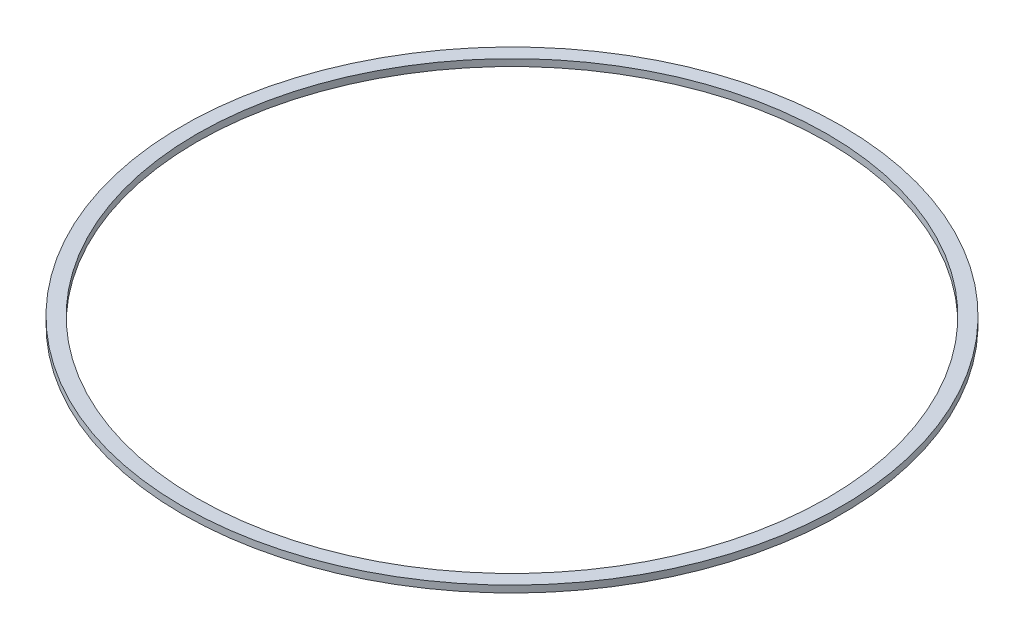
ISO-10303-21;
HEADER;
FILE_DESCRIPTION(('STEP AP214'),'2;1');
FILE_NAME('part.step','',(''),(''),'','','');
FILE_SCHEMA(('AUTOMOTIVE_DESIGN { 1 0 10303 214 1 1 1 1 }'));
ENDSEC;
DATA;
#1=APPLICATION_CONTEXT('core data for automotive mechanical design processes');
#2=APPLICATION_PROTOCOL_DEFINITION('international standard','automotive_design',2000,#1);
#3=PRODUCT_CONTEXT('',#1,'mechanical');
#4=PRODUCT('Part','Part','',(#3));
#5=PRODUCT_RELATED_PRODUCT_CATEGORY('part','',(#4));
#6=PRODUCT_DEFINITION_FORMATION('','',#4);
#7=PRODUCT_DEFINITION_CONTEXT('part definition',#1,'design');
#8=PRODUCT_DEFINITION('design','',#6,#7);
#9=PRODUCT_DEFINITION_SHAPE('','',#8);
#10=(LENGTH_UNIT() NAMED_UNIT(*) SI_UNIT(.MILLI.,.METRE.));
#11=(NAMED_UNIT(*) PLANE_ANGLE_UNIT() SI_UNIT($,.RADIAN.));
#12=(NAMED_UNIT(*) SI_UNIT($,.STERADIAN.) SOLID_ANGLE_UNIT());
#13=UNCERTAINTY_MEASURE_WITH_UNIT(LENGTH_MEASURE(1.E-05),#10,'distance_accuracy_value','');
#14=(GEOMETRIC_REPRESENTATION_CONTEXT(3) GLOBAL_UNCERTAINTY_ASSIGNED_CONTEXT((#13)) GLOBAL_UNIT_ASSIGNED_CONTEXT((#10,
#11,#12)) REPRESENTATION_CONTEXT('',''));
#15=CARTESIAN_POINT('',(0.,0.,0.));
#16=DIRECTION('',(0.,0.,1.));
#17=DIRECTION('',(1.,0.,0.));
#18=AXIS2_PLACEMENT_3D('',#15,#16,#17);
#19=CARTESIAN_POINT('',(0.,0.,0.));
#20=DIRECTION('',(0.,-1.,0.));
#21=DIRECTION('',(0.,0.,-1.));
#22=AXIS2_PLACEMENT_3D('',#19,#20,#21);
#23=CYLINDRICAL_SURFACE('',#22,55.2);
#24=CARTESIAN_POINT('',(0.,9.3,0.));
#25=DIRECTION('',(0.,-1.,0.));
#26=DIRECTION('',(0.,0.,-1.));
#27=AXIS2_PLACEMENT_3D('',#24,#25,#26);
#28=CIRCLE('',#27,55.2);
#29=CARTESIAN_POINT('',(0.,9.3,-55.2));
#30=VERTEX_POINT('',#29);
#31=EDGE_CURVE('E49',#30,#30,#28,.T.);
#32=ORIENTED_EDGE('',*,*,#31,.F.);
#33=EDGE_LOOP('',(#32));
#34=FACE_BOUND('',#33,.T.);
#35=CARTESIAN_POINT('',(0.,8.1,0.));
#36=DIRECTION('',(0.,-1.,0.));
#37=DIRECTION('',(0.,0.,-1.));
#38=AXIS2_PLACEMENT_3D('',#35,#36,#37);
#39=CIRCLE('',#38,55.2);
#40=CARTESIAN_POINT('',(0.,8.1,-55.2));
#41=VERTEX_POINT('',#40);
#42=EDGE_CURVE('E10',#41,#41,#39,.T.);
#43=ORIENTED_EDGE('',*,*,#42,.T.);
#44=EDGE_LOOP('',(#43));
#45=FACE_BOUND('',#44,.T.);
#46=ADVANCED_FACE('F35',(#34,#45),#23,.F.);
#47=CARTESIAN_POINT('',(-55.2,8.1,0.));
#48=DIRECTION('',(0.,1.,0.));
#49=DIRECTION('',(0.,0.,1.));
#50=AXIS2_PLACEMENT_3D('',#47,#48,#49);
#51=PLANE('',#50);
#52=ORIENTED_EDGE('',*,*,#42,.F.);
#53=EDGE_LOOP('',(#52));
#54=FACE_BOUND('',#53,.T.);
#55=CARTESIAN_POINT('',(0.,8.1,0.));
#56=DIRECTION('',(0.,-1.,0.));
#57=DIRECTION('',(0.,0.,-1.));
#58=AXIS2_PLACEMENT_3D('',#55,#56,#57);
#59=CIRCLE('',#58,57.7);
#60=CARTESIAN_POINT('',(0.,8.1,-57.7));
#61=VERTEX_POINT('',#60);
#62=EDGE_CURVE('E41',#61,#61,#59,.T.);
#63=ORIENTED_EDGE('',*,*,#62,.T.);
#64=EDGE_LOOP('',(#63));
#65=FACE_BOUND('',#64,.T.);
#66=ADVANCED_FACE('F58',(#54,#65),#51,.F.);
#67=CARTESIAN_POINT('',(0.,0.,0.));
#68=DIRECTION('',(0.,-1.,0.));
#69=DIRECTION('',(0.,0.,-1.));
#70=AXIS2_PLACEMENT_3D('',#67,#68,#69);
#71=CYLINDRICAL_SURFACE('',#70,57.7);
#72=ORIENTED_EDGE('',*,*,#62,.F.);
#73=EDGE_LOOP('',(#72));
#74=FACE_BOUND('',#73,.T.);
#75=CARTESIAN_POINT('',(0.,9.3,0.));
#76=DIRECTION('',(0.,-1.,0.));
#77=DIRECTION('',(0.,0.,-1.));
#78=AXIS2_PLACEMENT_3D('',#75,#76,#77);
#79=CIRCLE('',#78,57.7);
#80=CARTESIAN_POINT('',(0.,9.3,-57.7));
#81=VERTEX_POINT('',#80);
#82=EDGE_CURVE('E45',#81,#81,#79,.T.);
#83=ORIENTED_EDGE('',*,*,#82,.T.);
#84=EDGE_LOOP('',(#83));
#85=FACE_BOUND('',#84,.T.);
#86=ADVANCED_FACE('F62',(#74,#85),#71,.T.);
#87=CARTESIAN_POINT('',(-55.2,9.3,0.));
#88=DIRECTION('',(0.,-1.,0.));
#89=DIRECTION('',(0.,0.,-1.));
#90=AXIS2_PLACEMENT_3D('',#87,#88,#89);
#91=PLANE('',#90);
#92=ORIENTED_EDGE('',*,*,#82,.F.);
#93=EDGE_LOOP('',(#92));
#94=FACE_BOUND('',#93,.T.);
#95=ORIENTED_EDGE('',*,*,#31,.T.);
#96=EDGE_LOOP('',(#95));
#97=FACE_BOUND('',#96,.T.);
#98=ADVANCED_FACE('F55',(#94,#97),#91,.F.);
#99=CLOSED_SHELL('',(#46,#66,#86,#98));
#100=MANIFOLD_SOLID_BREP('B2',#99);
#101=ADVANCED_BREP_SHAPE_REPRESENTATION('',(#18,#100),#14);
#102=SHAPE_DEFINITION_REPRESENTATION(#9,#101);
ENDSEC;
END-ISO-10303-21;
